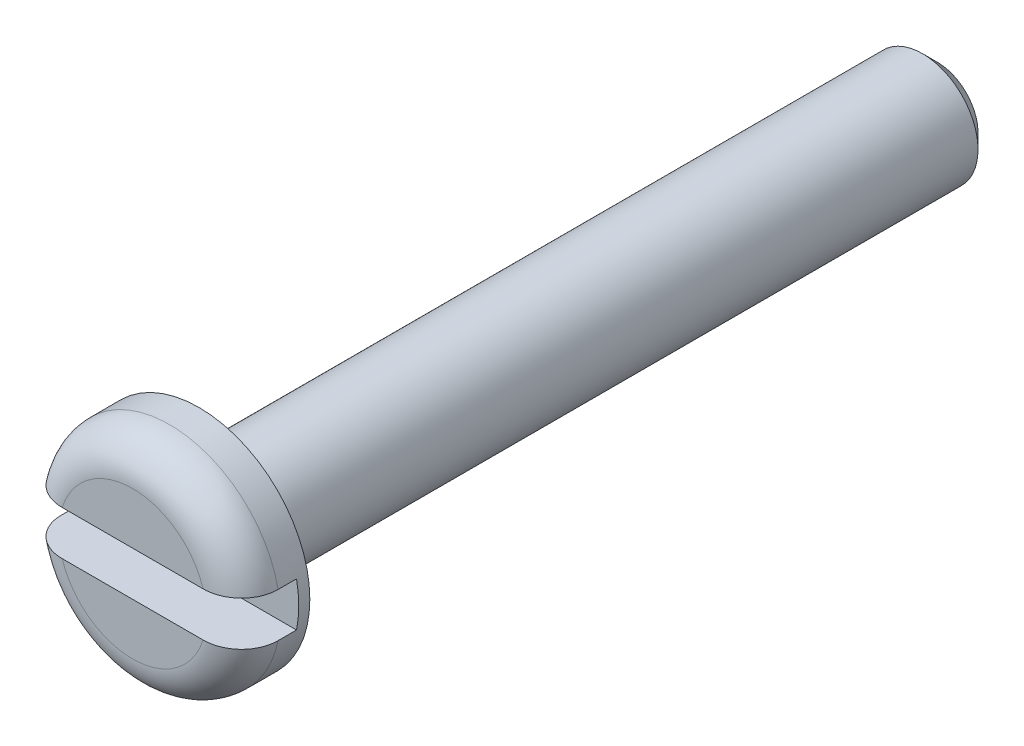
ISO-10303-21;
HEADER;
FILE_DESCRIPTION(('STEP AP214'),'2;1');
FILE_NAME('part.step','',(''),(''),'','','');
FILE_SCHEMA(('AUTOMOTIVE_DESIGN { 1 0 10303 214 1 1 1 1 }'));
ENDSEC;
DATA;
#1=APPLICATION_CONTEXT('core data for automotive mechanical design processes');
#2=APPLICATION_PROTOCOL_DEFINITION('international standard','automotive_design',2000,#1);
#3=PRODUCT_CONTEXT('',#1,'mechanical');
#4=PRODUCT('Part','Part','',(#3));
#5=PRODUCT_RELATED_PRODUCT_CATEGORY('part','',(#4));
#6=PRODUCT_DEFINITION_FORMATION('','',#4);
#7=PRODUCT_DEFINITION_CONTEXT('part definition',#1,'design');
#8=PRODUCT_DEFINITION('design','',#6,#7);
#9=PRODUCT_DEFINITION_SHAPE('','',#8);
#10=(LENGTH_UNIT() NAMED_UNIT(*) SI_UNIT(.MILLI.,.METRE.));
#11=(NAMED_UNIT(*) PLANE_ANGLE_UNIT() SI_UNIT($,.RADIAN.));
#12=(NAMED_UNIT(*) SI_UNIT($,.STERADIAN.) SOLID_ANGLE_UNIT());
#13=UNCERTAINTY_MEASURE_WITH_UNIT(LENGTH_MEASURE(1.E-05),#10,'distance_accuracy_value','');
#14=(GEOMETRIC_REPRESENTATION_CONTEXT(3) GLOBAL_UNCERTAINTY_ASSIGNED_CONTEXT((#13)) GLOBAL_UNIT_ASSIGNED_CONTEXT((#10,
#11,#12)) REPRESENTATION_CONTEXT('',''));
#15=CARTESIAN_POINT('',(0.,0.,0.));
#16=DIRECTION('',(0.,0.,1.));
#17=DIRECTION('',(1.,0.,0.));
#18=AXIS2_PLACEMENT_3D('',#15,#16,#17);
#19=CARTESIAN_POINT('',(0.,0.,0.));
#20=DIRECTION('',(0.,0.,0.999999999999933));
#21=DIRECTION('',(0.999999999999995,0.,0.));
#22=AXIS2_PLACEMENT_3D('',#19,#20,#21);
#23=PLANE('',#22);
#24=DIRECTION('',(0.999999999999995,0.,0.));
#25=VECTOR('',#24,1.);
#26=CARTESIAN_POINT('',(-2.99999999999982,-0.599999999999656,0.));
#27=LINE('',#26,#25);
#28=CARTESIAN_POINT('',(-1.90787840283328,-0.599999999999712,0.));
#29=VERTEX_POINT('',#28);
#30=CARTESIAN_POINT('',(1.90787840283384,-0.599999999999656,0.));
#31=VERTEX_POINT('',#30);
#32=EDGE_CURVE('E138',#29,#31,#27,.T.);
#33=ORIENTED_EDGE('',*,*,#32,.F.);
#34=CARTESIAN_POINT('',(0.,0.,0.));
#35=DIRECTION('',(0.,0.,0.999999999999933));
#36=DIRECTION('',(0.999999999999995,0.,0.));
#37=AXIS2_PLACEMENT_3D('',#34,#35,#36);
#38=CIRCLE('',#37,2.);
#39=EDGE_CURVE('E154',#29,#31,#38,.T.);
#40=ORIENTED_EDGE('',*,*,#39,.T.);
#41=EDGE_LOOP('',(#33,#40));
#42=FACE_BOUND('',#41,.T.);
#43=ADVANCED_FACE('F48',(#42),#23,.T.);
#44=DIRECTION('',(0.999999999999995,0.,0.));
#45=VECTOR('',#44,1.);
#46=CARTESIAN_POINT('',(-2.99999999999939,0.60000000000035,0.));
#47=LINE('',#46,#45);
#48=CARTESIAN_POINT('',(-1.907878402833,0.60000000000035,0.));
#49=VERTEX_POINT('',#48);
#50=CARTESIAN_POINT('',(1.9078784028347,0.600000000000073,0.));
#51=VERTEX_POINT('',#50);
#52=EDGE_CURVE('E120',#49,#51,#47,.T.);
#53=ORIENTED_EDGE('',*,*,#52,.T.);
#54=CARTESIAN_POINT('',(0.,0.,0.));
#55=DIRECTION('',(0.,0.,0.999999999999933));
#56=DIRECTION('',(0.999999999999995,0.,0.));
#57=AXIS2_PLACEMENT_3D('',#54,#55,#56);
#58=CIRCLE('',#57,2.);
#59=EDGE_CURVE('E69',#51,#49,#58,.T.);
#60=ORIENTED_EDGE('',*,*,#59,.T.);
#61=EDGE_LOOP('',(#53,#60));
#62=FACE_BOUND('',#61,.T.);
#63=ADVANCED_FACE('F202',(#62),#23,.T.);
#64=CARTESIAN_POINT('',(2.08166817117217E-13,-1.16573417585641E-12,-21.8));
#65=DIRECTION('',(0.,0.,-0.999999999999933));
#66=DIRECTION('',(-0.999999999999995,0.,0.));
#67=AXIS2_PLACEMENT_3D('',#64,#65,#66);
#68=CYLINDRICAL_SURFACE('',#67,3.);
#69=DIRECTION('',(0.,0.,-0.999999999999933));
#70=VECTOR('',#69,1.);
#71=CARTESIAN_POINT('',(2.93938769134053,-0.600000000001072,-21.8));
#72=LINE('',#71,#70);
#73=CARTESIAN_POINT('',(2.93938769134074,-0.599999999999462,-1.));
#74=VERTEX_POINT('',#73);
#75=CARTESIAN_POINT('',(2.93938769134068,-0.599999999999268,-1.5));
#76=VERTEX_POINT('',#75);
#77=EDGE_CURVE('E111',#74,#76,#72,.T.);
#78=ORIENTED_EDGE('',*,*,#77,.F.);
#79=CARTESIAN_POINT('',(0.,0.,-1.));
#80=DIRECTION('',(0.,0.,0.999999999999933));
#81=DIRECTION('',(0.999999999999995,0.,0.));
#82=AXIS2_PLACEMENT_3D('',#79,#80,#81);
#83=CIRCLE('',#82,3.);
#84=CARTESIAN_POINT('',(-2.93938769133913,-0.599999999999851,-1.));
#85=VERTEX_POINT('',#84);
#86=EDGE_CURVE('E155',#74,#85,#83,.F.);
#87=ORIENTED_EDGE('',*,*,#86,.T.);
#88=DIRECTION('',(0.,0.,-0.999999999999933));
#89=VECTOR('',#88,1.);
#90=CARTESIAN_POINT('',(-2.93938769133925,-0.600000000001127,-21.8));
#91=LINE('',#90,#89);
#92=CARTESIAN_POINT('',(-2.93938769133913,-0.599999999999851,-1.5));
#93=VERTEX_POINT('',#92);
#94=EDGE_CURVE('E128',#93,#85,#91,.F.);
#95=ORIENTED_EDGE('',*,*,#94,.F.);
#96=CARTESIAN_POINT('',(0.,0.,-1.5));
#97=DIRECTION('',(0.,0.,-0.999999999999933));
#98=DIRECTION('',(-0.999999999999995,0.,0.));
#99=AXIS2_PLACEMENT_3D('',#96,#97,#98);
#100=CIRCLE('',#99,3.);
#101=CARTESIAN_POINT('',(-2.93938769133913,0.600000000000378,-1.5));
#102=VERTEX_POINT('',#101);
#103=EDGE_CURVE('E112',#102,#93,#100,.F.);
#104=ORIENTED_EDGE('',*,*,#103,.F.);
#105=DIRECTION('',(0.,0.,-0.999999999999933));
#106=VECTOR('',#105,1.);
#107=CARTESIAN_POINT('',(-2.93938769133907,0.599999999998907,-21.8));
#108=LINE('',#107,#106);
#109=CARTESIAN_POINT('',(-2.93938769133893,0.600000000000156,-1.));
#110=VERTEX_POINT('',#109);
#111=EDGE_CURVE('E100',#110,#102,#108,.T.);
#112=ORIENTED_EDGE('',*,*,#111,.F.);
#113=CARTESIAN_POINT('',(0.,0.,-1.));
#114=DIRECTION('',(0.,0.,0.999999999999933));
#115=DIRECTION('',(0.999999999999995,0.,0.));
#116=AXIS2_PLACEMENT_3D('',#113,#114,#115);
#117=CIRCLE('',#116,3.);
#118=CARTESIAN_POINT('',(2.93938769134074,0.600000000000045,-1.));
#119=VERTEX_POINT('',#118);
#120=EDGE_CURVE('E158',#110,#119,#117,.F.);
#121=ORIENTED_EDGE('',*,*,#120,.T.);
#122=DIRECTION('',(0.,0.,-0.999999999999933));
#123=VECTOR('',#122,1.);
#124=CARTESIAN_POINT('',(2.93938769134056,0.59999999999813,-21.8));
#125=LINE('',#124,#123);
#126=CARTESIAN_POINT('',(2.93938769134072,0.599999999999906,-1.5));
#127=VERTEX_POINT('',#126);
#128=EDGE_CURVE('E129',#127,#119,#125,.F.);
#129=ORIENTED_EDGE('',*,*,#128,.F.);
#130=EDGE_CURVE('E119',#76,#127,#100,.F.);
#131=ORIENTED_EDGE('',*,*,#130,.F.);
#132=EDGE_LOOP('',(#78,#87,#95,#104,#112,#121,#129,#131));
#133=FACE_BOUND('',#132,.T.);
#134=CARTESIAN_POINT('',(0.,0.,-1.8));
#135=DIRECTION('',(0.,0.,-0.999999999999933));
#136=DIRECTION('',(-0.999999999999995,0.,0.));
#137=AXIS2_PLACEMENT_3D('',#134,#135,#136);
#138=CIRCLE('',#137,3.);
#139=CARTESIAN_POINT('',(-2.99999999999998,0.,-1.8));
#140=VERTEX_POINT('',#139);
#141=EDGE_CURVE('E133',#140,#140,#138,.T.);
#142=ORIENTED_EDGE('',*,*,#141,.F.);
#143=EDGE_LOOP('',(#142));
#144=FACE_BOUND('',#143,.T.);
#145=ADVANCED_FACE('F124',(#133,#144),#68,.T.);
#146=CARTESIAN_POINT('',(-2.99999999999945,3.33066907387547E-13,-1.8));
#147=DIRECTION('',(0.,0.,-0.999999999999933));
#148=DIRECTION('',(-0.999999999999995,0.,0.));
#149=AXIS2_PLACEMENT_3D('',#146,#147,#148);
#150=PLANE('',#149);
#151=CARTESIAN_POINT('',(0.,0.,-1.8));
#152=DIRECTION('',(0.,0.,-0.999999999999933));
#153=DIRECTION('',(-0.999999999999995,0.,0.));
#154=AXIS2_PLACEMENT_3D('',#151,#152,#153);
#155=CIRCLE('',#154,1.9);
#156=CARTESIAN_POINT('',(-1.89999999999999,0.,-1.8));
#157=VERTEX_POINT('',#156);
#158=EDGE_CURVE('E13',#157,#157,#155,.F.);
#159=ORIENTED_EDGE('',*,*,#158,.T.);
#160=EDGE_LOOP('',(#159));
#161=FACE_BOUND('',#160,.T.);
#162=ORIENTED_EDGE('',*,*,#141,.T.);
#163=EDGE_LOOP('',(#162));
#164=FACE_BOUND('',#163,.T.);
#165=ADVANCED_FACE('F233',(#161,#164),#150,.T.);
#166=CARTESIAN_POINT('',(2.08166817117217E-13,-1.16573417585641E-12,-21.8));
#167=DIRECTION('',(0.,0.,-0.999999999999933));
#168=DIRECTION('',(-0.999999999999995,0.,0.));
#169=AXIS2_PLACEMENT_3D('',#166,#167,#168);
#170=CYLINDRICAL_SURFACE('',#169,1.5);
#171=CARTESIAN_POINT('',(0.,0.,-2.20000000000001));
#172=DIRECTION('',(0.,0.,-0.999999999999933));
#173=DIRECTION('',(-0.999999999999995,0.,0.));
#174=AXIS2_PLACEMENT_3D('',#171,#172,#173);
#175=CIRCLE('',#174,1.5);
#176=CARTESIAN_POINT('',(-1.49999999999999,0.,-2.20000000000001));
#177=VERTEX_POINT('',#176);
#178=EDGE_CURVE('E56',#177,#177,#175,.T.);
#179=ORIENTED_EDGE('',*,*,#178,.T.);
#180=EDGE_LOOP('',(#179));
#181=FACE_BOUND('',#180,.T.);
#182=CARTESIAN_POINT('',(2.08166817117217E-13,-1.16573417585641E-12,-21.4));
#183=DIRECTION('',(0.,0.,-0.999999999999933));
#184=DIRECTION('',(-0.999999999999995,0.,0.));
#185=AXIS2_PLACEMENT_3D('',#182,#183,#184);
#186=CIRCLE('',#185,1.5);
#187=CARTESIAN_POINT('',(-1.49999999999978,-1.15907283770866E-12,-21.4));
#188=VERTEX_POINT('',#187);
#189=EDGE_CURVE('E216',#188,#188,#186,.F.);
#190=ORIENTED_EDGE('',*,*,#189,.T.);
#191=EDGE_LOOP('',(#190));
#192=FACE_BOUND('',#191,.T.);
#193=ADVANCED_FACE('F228',(#181,#192),#170,.T.);
#194=CARTESIAN_POINT('',(-1.49999999999972,-1.55431223447522E-12,-21.8));
#195=DIRECTION('',(0.,0.,-0.999999999999933));
#196=DIRECTION('',(-0.999999999999995,0.,0.));
#197=AXIS2_PLACEMENT_3D('',#194,#195,#196);
#198=PLANE('',#197);
#199=CARTESIAN_POINT('',(2.08166817117217E-13,-1.16573417585641E-12,-21.8));
#200=DIRECTION('',(0.,0.,-0.999999999999933));
#201=DIRECTION('',(-0.999999999999995,0.,0.));
#202=AXIS2_PLACEMENT_3D('',#199,#200,#201);
#203=CIRCLE('',#202,1.09999999999999);
#204=CARTESIAN_POINT('',(-1.09999999999978,-1.16084919454806E-12,-21.8));
#205=VERTEX_POINT('',#204);
#206=EDGE_CURVE('E219',#205,#205,#203,.T.);
#207=ORIENTED_EDGE('',*,*,#206,.T.);
#208=EDGE_LOOP('',(#207));
#209=FACE_BOUND('',#208,.T.);
#210=ADVANCED_FACE('F232',(#209),#198,.T.);
#211=CARTESIAN_POINT('',(-2.99999999999918,0.600000000000489,-1.5));
#212=DIRECTION('',(0.,0.,-0.999999999999933));
#213=DIRECTION('',(-0.999999999999995,0.,0.));
#214=AXIS2_PLACEMENT_3D('',#211,#212,#213);
#215=PLANE('',#214);
#216=DIRECTION('',(0.999999999999995,0.,0.));
#217=VECTOR('',#216,1.);
#218=CARTESIAN_POINT('',(-2.99999999999935,-0.599999999999601,-1.5));
#219=LINE('',#218,#217);
#220=EDGE_CURVE('E135',#93,#76,#219,.T.);
#221=ORIENTED_EDGE('',*,*,#220,.T.);
#222=ORIENTED_EDGE('',*,*,#130,.T.);
#223=DIRECTION('',(0.999999999999995,0.,0.));
#224=VECTOR('',#223,1.);
#225=CARTESIAN_POINT('',(-2.99999999999918,0.600000000000489,-1.5));
#226=LINE('',#225,#224);
#227=EDGE_CURVE('E103',#102,#127,#226,.T.);
#228=ORIENTED_EDGE('',*,*,#227,.F.);
#229=ORIENTED_EDGE('',*,*,#103,.T.);
#230=EDGE_LOOP('',(#221,#222,#228,#229));
#231=FACE_BOUND('',#230,.T.);
#232=ADVANCED_FACE('F116',(#231),#215,.F.);
#233=CARTESIAN_POINT('',(-2.99999999999982,-0.599999999999656,0.));
#234=DIRECTION('',(0.,-0.999999999999997,0.));
#235=DIRECTION('',(0.,0.,-0.999999999999933));
#236=AXIS2_PLACEMENT_3D('',#233,#234,#235);
#237=PLANE('',#236);
#238=ORIENTED_EDGE('',*,*,#94,.T.);
#239=CARTESIAN_POINT('',(-2.93938769133913,-0.599999999999851,-1.));
#240=CARTESIAN_POINT('',(-2.93938770276747,-0.599999999999736,-0.972321638172505));
#241=CARTESIAN_POINT('',(-2.93821410236518,-0.59999999999968,-0.944656636253209));
#242=CARTESIAN_POINT('',(-2.93353349431537,-0.599999999999633,-0.889526861951114));
#243=CARTESIAN_POINT('',(-2.93002666366261,-0.599999999999642,-0.862062074540145));
#244=CARTESIAN_POINT('',(-2.91604632548895,-0.599999999999686,-0.780336207939811));
#245=CARTESIAN_POINT('',(-2.90211283648021,-0.599999999999741,-0.72662626947404));
#246=CARTESIAN_POINT('',(-2.86543751133039,-0.599999999999738,-0.622315882638972));
#247=CARTESIAN_POINT('',(-2.84269266515644,-0.599999999999679,-0.571716503714175));
#248=CARTESIAN_POINT('',(-2.78908511252599,-0.599999999999635,-0.475017339731202));
#249=CARTESIAN_POINT('',(-2.75822276982163,-0.599999999999649,-0.428917353178192));
#250=CARTESIAN_POINT('',(-2.68907078438895,-0.599999999999608,-0.342172235650517));
#251=CARTESIAN_POINT('',(-2.65073286093566,-0.599999999999554,-0.301565637861695));
#252=CARTESIAN_POINT('',(-2.56789366745153,-0.599999999999762,-0.227220078446948));
#253=CARTESIAN_POINT('',(-2.52339168993967,-0.600000000000024,-0.193481906245859));
#254=CARTESIAN_POINT('',(-2.42861084794098,-0.60000000000001,-0.133118586778761));
#255=CARTESIAN_POINT('',(-2.3782382220027,-0.599999999999723,-0.10664090172408));
#256=CARTESIAN_POINT('',(-2.27384844267076,-0.599999999999594,-0.0622394746540715));
#257=CARTESIAN_POINT('',(-2.21983105484792,-0.599999999999753,-0.0443162834590504));
#258=CARTESIAN_POINT('',(-2.1227273979579,-0.599999999999778,-0.0205271433836863));
#259=CARTESIAN_POINT('',(-2.08008208035684,-0.599999999999706,-0.0128109577035128));
#260=CARTESIAN_POINT('',(-1.99425117998429,-0.599999999999614,-0.00254656462197939));
#261=CARTESIAN_POINT('',(-1.95106672025973,-0.599999999999594,1.10118980224254E-05));
#262=CARTESIAN_POINT('',(-1.90787840283328,-0.599999999999712,0.));
#263=B_SPLINE_CURVE_WITH_KNOTS('',3,(#239,#240,#241,#242,#243,#244,#245,#246,#247,#248,#249,
#250,#251,#252,#253,#254,#255,#256,#257,#258,#259,#260,#261,#262),.UNSPECIFIED.,.F.,.F.,(4,2,2,
2,2,2,2,2,2,2,2,4),(0.,0.0829837302475468,0.165961166211809,0.331568485715448,0.49723242801339,
0.662888948029246,0.829653081163323,0.996436370582126,1.16639122945763,1.33635703018008,
1.46606963518877,1.59554644193479),.UNSPECIFIED.);
#264=EDGE_CURVE('E148',#85,#29,#263,.T.);
#265=ORIENTED_EDGE('',*,*,#264,.T.);
#266=ORIENTED_EDGE('',*,*,#32,.T.);
#267=CARTESIAN_POINT('',(1.90787840283384,-0.599999999999656,0.));
#268=CARTESIAN_POINT('',(1.93773529066292,-0.599999999999659,-2.47548811773881E-07));
#269=CARTESIAN_POINT('',(1.9675801757024,-0.599999999999667,-0.0012177033462785));
#270=CARTESIAN_POINT('',(2.02707319186677,-0.599999999999679,-0.00610610499446207));
#271=CARTESIAN_POINT('',(2.05672128723239,-0.599999999999682,-0.00977748506080412));
#272=CARTESIAN_POINT('',(2.14508838456884,-0.599999999999656,-0.0244993421219115));
#273=CARTESIAN_POINT('',(2.20323726850191,-0.599999999999591,-0.0392575272753844));
#274=CARTESIAN_POINT('',(2.31624809768395,-0.59999999999961,-0.0784798945949711));
#275=CARTESIAN_POINT('',(2.37110469866024,-0.599999999999695,-0.102959391387275));
#276=CARTESIAN_POINT('',(2.47571188316498,-0.599999999999655,-0.161057784490005));
#277=CARTESIAN_POINT('',(2.52546640218065,-0.599999999999531,-0.194669562459368));
#278=CARTESIAN_POINT('',(2.61684428964105,-0.599999999999504,-0.268970846938774));
#279=CARTESIAN_POINT('',(2.65867082350496,-0.599999999999595,-0.309410609138006));
#280=CARTESIAN_POINT('',(2.73471620678024,-0.599999999999757,-0.396932843703682));
#281=CARTESIAN_POINT('',(2.76893342699625,-0.599999999999828,-0.444016735093816));
#282=CARTESIAN_POINT('',(2.82779584490335,-0.599999999999763,-0.542047078322585));
#283=CARTESIAN_POINT('',(2.85267997210067,-0.599999999999631,-0.59285037734866));
#284=CARTESIAN_POINT('',(2.89338734810261,-0.599999999999721,-0.697941697102551));
#285=CARTESIAN_POINT('',(2.90921915700783,-0.599999999999942,-0.75222637153684));
#286=CARTESIAN_POINT('',(2.92663542181681,-0.599999999999885,-0.839129838729088));
#287=CARTESIAN_POINT('',(2.93141571310156,-0.59999999999978,-0.871141118720808));
#288=CARTESIAN_POINT('',(2.93779035512944,-0.599999999999573,-0.935429884254464));
#289=CARTESIAN_POINT('',(2.93938956207206,-0.599999999999473,-0.967706888381755));
#290=CARTESIAN_POINT('',(2.93938769134074,-0.599999999999462,-1.));
#291=B_SPLINE_CURVE_WITH_KNOTS('',3,(#267,#268,#269,#270,#271,#272,#273,#274,#275,#276,#277,
#278,#279,#280,#281,#282,#283,#284,#285,#286,#287,#288,#289,#290),.UNSPECIFIED.,.F.,.F.,(4,2,2,
2,2,2,2,2,2,2,2,4),(0.,0.0895205676365288,0.179056979903623,0.358108854015165,0.537443926549181,
0.716639611791197,0.890318718479793,1.06403497508301,1.23293840849232,1.40168185727563,
1.49863809906656,1.59544621485484),.UNSPECIFIED.);
#292=EDGE_CURVE('E147',#31,#74,#291,.T.);
#293=ORIENTED_EDGE('',*,*,#292,.T.);
#294=ORIENTED_EDGE('',*,*,#77,.T.);
#295=ORIENTED_EDGE('',*,*,#220,.F.);
#296=EDGE_LOOP('',(#238,#265,#266,#293,#294,#295));
#297=FACE_BOUND('',#296,.T.);
#298=ADVANCED_FACE('F146',(#297),#237,.F.);
#299=CARTESIAN_POINT('',(-2.99999999999939,0.60000000000035,0.));
#300=DIRECTION('',(0.,0.999999999999997,0.));
#301=DIRECTION('',(0.,0.,0.999999999999933));
#302=AXIS2_PLACEMENT_3D('',#299,#300,#301);
#303=PLANE('',#302);
#304=ORIENTED_EDGE('',*,*,#128,.T.);
#305=CARTESIAN_POINT('',(2.93938769134074,0.600000000000045,-1.));
#306=CARTESIAN_POINT('',(2.93938770276805,0.600000000000203,-0.972321638172598));
#307=CARTESIAN_POINT('',(2.93821410236527,0.600000000000291,-0.944656636253406));
#308=CARTESIAN_POINT('',(2.93353349431504,0.60000000000037,-0.889526861951407));
#309=CARTESIAN_POINT('',(2.93002666366237,0.600000000000362,-0.86206207454043));
#310=CARTESIAN_POINT('',(2.91604632548915,0.600000000000267,-0.780336207939984));
#311=CARTESIAN_POINT('',(2.90211283648096,0.600000000000107,-0.726626269474001));
#312=CARTESIAN_POINT('',(2.86543751133107,0.600000000000149,-0.622315882639039));
#313=CARTESIAN_POINT('',(2.84269266515649,0.600000000000352,-0.57171650371456));
#314=CARTESIAN_POINT('',(2.78908511252604,0.600000000000309,-0.475017339731541));
#315=CARTESIAN_POINT('',(2.75822276982231,0.600000000000065,-0.428917353178167));
#316=CARTESIAN_POINT('',(2.6890707843898,0.600000000000025,-0.342172235650496));
#317=CARTESIAN_POINT('',(2.65073286093604,0.600000000000233,-0.301565637862053));
#318=CARTESIAN_POINT('',(2.56789366745168,0.600000000000429,-0.227220078447345));
#319=CARTESIAN_POINT('',(2.52339168994005,0.600000000000418,-0.193481906245916));
#320=CARTESIAN_POINT('',(2.42861084794152,0.60000000000045,-0.133118586778761));
#321=CARTESIAN_POINT('',(2.37823822200315,0.600000000000495,-0.106640901724359));
#322=CARTESIAN_POINT('',(2.27384844267131,0.60000000000017,-0.0622394746543674));
#323=CARTESIAN_POINT('',(2.21983105484866,0.5999999999998,-0.0443162834590833));
#324=CARTESIAN_POINT('',(2.12272739795887,0.59999999999989,-0.0205271433836715));
#325=CARTESIAN_POINT('',(2.08008208035789,0.600000000000174,-0.0128109577036121));
#326=CARTESIAN_POINT('',(1.9942511799855,0.600000000000493,-0.00254656462219786));
#327=CARTESIAN_POINT('',(1.95106672026101,0.600000000000528,1.10118977967835E-05));
#328=CARTESIAN_POINT('',(1.9078784028347,0.600000000000073,0.));
#329=B_SPLINE_CURVE_WITH_KNOTS('',3,(#305,#306,#307,#308,#309,#310,#311,#312,#313,#314,#315,
#316,#317,#318,#319,#320,#321,#322,#323,#324,#325,#326,#327,#328),.UNSPECIFIED.,.F.,.F.,(4,2,2,
2,2,2,2,2,2,2,2,4),(0.,0.0829837302473331,0.165961166211638,0.331568485715309,0.497232428013197,
0.662888948028944,0.82965308116309,0.996436370582009,1.16639122945731,1.33635703017952,
1.46606963518789,1.59554644193364),.UNSPECIFIED.);
#330=EDGE_CURVE('E63',#119,#51,#329,.T.);
#331=ORIENTED_EDGE('',*,*,#330,.T.);
#332=ORIENTED_EDGE('',*,*,#52,.F.);
#333=CARTESIAN_POINT('',(-1.907878402833,0.60000000000035,0.));
#334=CARTESIAN_POINT('',(-1.93773529066208,0.600000000000318,-2.4754882422306E-07));
#335=CARTESIAN_POINT('',(-1.96758017570157,0.600000000000332,-0.00121770334625946));
#336=CARTESIAN_POINT('',(-2.02707319186593,0.600000000000362,-0.00610610499437776));
#337=CARTESIAN_POINT('',(-2.05672128723154,0.600000000000377,-0.00977748506068381));
#338=CARTESIAN_POINT('',(-2.14508838456791,0.600000000000288,-0.0244993421218104));
#339=CARTESIAN_POINT('',(-2.20323726850088,0.600000000000048,-0.0392575272754658));
#340=CARTESIAN_POINT('',(-2.31624809768299,0.600000000000097,-0.0784798945949001));
#341=CARTESIAN_POINT('',(-2.37110469865945,0.600000000000387,-0.102959391386874));
#342=CARTESIAN_POINT('',(-2.47571188316409,0.60000000000031,-0.161057784489655));
#343=CARTESIAN_POINT('',(-2.52546640217947,0.599999999999943,-0.194669562459399));
#344=CARTESIAN_POINT('',(-2.61684428964009,0.59999999999998,-0.268970846938769));
#345=CARTESIAN_POINT('',(-2.65867082350445,0.600000000000359,-0.309410609137613));
#346=CARTESIAN_POINT('',(-2.73471620677974,0.60000000000034,-0.396932843703266));
#347=CARTESIAN_POINT('',(-2.76893342699529,0.599999999999941,-0.444016735093764));
#348=CARTESIAN_POINT('',(-2.82779584490262,0.599999999999873,-0.542047078322607));
#349=CARTESIAN_POINT('',(-2.85267997210059,0.600000000000184,-0.592850377348405));
#350=CARTESIAN_POINT('',(-2.8933873481022,0.600000000000516,-0.697941697102284));
#351=CARTESIAN_POINT('',(-2.90921915700644,0.600000000000538,-0.752226371536837));
#352=CARTESIAN_POINT('',(-2.9266354218159,0.600000000000461,-0.839129838729095));
#353=CARTESIAN_POINT('',(-2.93141571310125,0.60000000000041,-0.871141118720735));
#354=CARTESIAN_POINT('',(-2.93779035512945,0.60000000000029,-0.935429884254309));
#355=CARTESIAN_POINT('',(-2.9393895620718,0.600000000000221,-0.967706888381597));
#356=CARTESIAN_POINT('',(-2.93938769133893,0.600000000000156,-1.));
#357=B_SPLINE_CURVE_WITH_KNOTS('',3,(#333,#334,#335,#336,#337,#338,#339,#340,#341,#342,#343,
#344,#345,#346,#347,#348,#349,#350,#351,#352,#353,#354,#355,#356),.UNSPECIFIED.,.F.,.F.,(4,2,2,
2,2,2,2,2,2,2,2,4),(0.,0.0895205676365397,0.179056979903564,0.358108854015007,0.537443926549022,
0.716639611791053,0.890318718479786,1.06403497508314,1.23293840849247,1.4016818572758,
1.49863809906675,1.59544621485506),.UNSPECIFIED.);
#358=EDGE_CURVE('E106',#49,#110,#357,.T.);
#359=ORIENTED_EDGE('',*,*,#358,.T.);
#360=ORIENTED_EDGE('',*,*,#111,.T.);
#361=ORIENTED_EDGE('',*,*,#227,.T.);
#362=EDGE_LOOP('',(#304,#331,#332,#359,#360,#361));
#363=FACE_BOUND('',#362,.T.);
#364=ADVANCED_FACE('F102',(#363),#303,.F.);
#365=CARTESIAN_POINT('',(2.08166817117217E-13,-1.16573417585641E-12,-21.8));
#366=DIRECTION('',(0.,0.,0.999999999999933));
#367=DIRECTION('',(0.999999999999995,0.,0.));
#368=AXIS2_PLACEMENT_3D('',#365,#366,#367);
#369=CONICAL_SURFACE('',#368,1.09999999999999,0.785398163397447);
#370=ORIENTED_EDGE('',*,*,#189,.F.);
#371=EDGE_LOOP('',(#370));
#372=FACE_BOUND('',#371,.T.);
#373=ORIENTED_EDGE('',*,*,#206,.F.);
#374=EDGE_LOOP('',(#373));
#375=FACE_BOUND('',#374,.T.);
#376=ADVANCED_FACE('F179',(#372,#375),#369,.T.);
#377=CARTESIAN_POINT('',(0.,0.,-1.));
#378=DIRECTION('',(0.,0.,0.999999999999933));
#379=DIRECTION('',(0.999999999999995,0.,0.));
#380=AXIS2_PLACEMENT_3D('',#377,#378,#379);
#381=TOROIDAL_SURFACE('',#380,2.,1.);
#382=ORIENTED_EDGE('',*,*,#292,.F.);
#383=ORIENTED_EDGE('',*,*,#39,.F.);
#384=ORIENTED_EDGE('',*,*,#264,.F.);
#385=ORIENTED_EDGE('',*,*,#86,.F.);
#386=EDGE_LOOP('',(#382,#383,#384,#385));
#387=FACE_BOUND('',#386,.T.);
#388=ADVANCED_FACE('F153',(#387),#381,.T.);
#389=CARTESIAN_POINT('',(0.,0.,-1.));
#390=DIRECTION('',(0.,0.,0.999999999999933));
#391=DIRECTION('',(0.999999999999995,0.,0.));
#392=AXIS2_PLACEMENT_3D('',#389,#390,#391);
#393=TOROIDAL_SURFACE('',#392,2.,1.);
#394=ORIENTED_EDGE('',*,*,#358,.F.);
#395=ORIENTED_EDGE('',*,*,#59,.F.);
#396=ORIENTED_EDGE('',*,*,#330,.F.);
#397=ORIENTED_EDGE('',*,*,#120,.F.);
#398=EDGE_LOOP('',(#394,#395,#396,#397));
#399=FACE_BOUND('',#398,.T.);
#400=ADVANCED_FACE('F191',(#399),#393,.T.);
#401=CARTESIAN_POINT('',(0.,0.,-2.20000000000001));
#402=DIRECTION('',(0.,0.,-0.999999999999933));
#403=DIRECTION('',(-0.999999999999995,0.,0.));
#404=AXIS2_PLACEMENT_3D('',#401,#402,#403);
#405=TOROIDAL_SURFACE('',#404,1.9,0.4);
#406=ORIENTED_EDGE('',*,*,#158,.F.);
#407=EDGE_LOOP('',(#406));
#408=FACE_BOUND('',#407,.T.);
#409=ORIENTED_EDGE('',*,*,#178,.F.);
#410=EDGE_LOOP('',(#409));
#411=FACE_BOUND('',#410,.T.);
#412=ADVANCED_FACE('F50',(#408,#411),#405,.F.);
#413=CLOSED_SHELL('',(#43,#63,#145,#165,#193,#210,#232,#298,#364,#376,#388,#400,#412));
#414=MANIFOLD_SOLID_BREP('B2',#413);
#415=ADVANCED_BREP_SHAPE_REPRESENTATION('',(#18,#414),#14);
#416=SHAPE_DEFINITION_REPRESENTATION(#9,#415);
ENDSEC;
END-ISO-10303-21;
